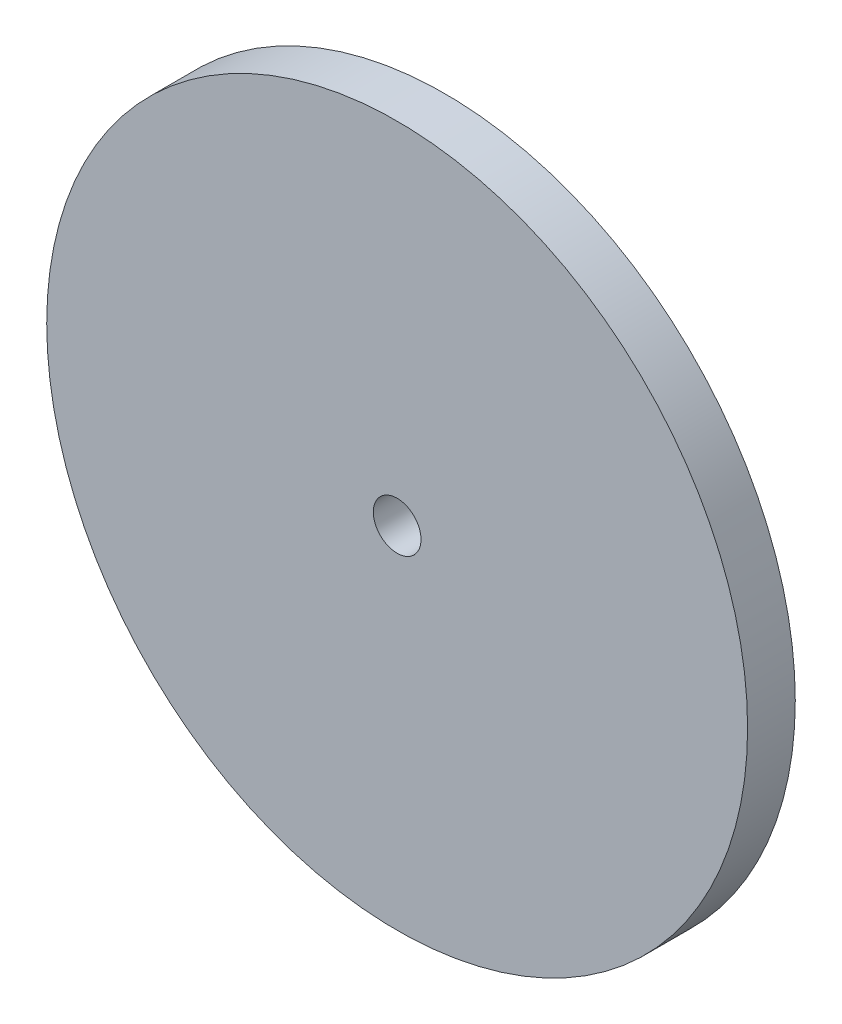
ISO-10303-21;
HEADER;
FILE_DESCRIPTION(('STEP AP214'),'2;1');
FILE_NAME('part.step','',(''),(''),'','','');
FILE_SCHEMA(('AUTOMOTIVE_DESIGN { 1 0 10303 214 1 1 1 1 }'));
ENDSEC;
DATA;
#1=APPLICATION_CONTEXT('core data for automotive mechanical design processes');
#2=APPLICATION_PROTOCOL_DEFINITION('international standard','automotive_design',2000,#1);
#3=PRODUCT_CONTEXT('',#1,'mechanical');
#4=PRODUCT('Part','Part','',(#3));
#5=PRODUCT_RELATED_PRODUCT_CATEGORY('part','',(#4));
#6=PRODUCT_DEFINITION_FORMATION('','',#4);
#7=PRODUCT_DEFINITION_CONTEXT('part definition',#1,'design');
#8=PRODUCT_DEFINITION('design','',#6,#7);
#9=PRODUCT_DEFINITION_SHAPE('','',#8);
#10=(LENGTH_UNIT() NAMED_UNIT(*) SI_UNIT(.MILLI.,.METRE.));
#11=(NAMED_UNIT(*) PLANE_ANGLE_UNIT() SI_UNIT($,.RADIAN.));
#12=(NAMED_UNIT(*) SI_UNIT($,.STERADIAN.) SOLID_ANGLE_UNIT());
#13=UNCERTAINTY_MEASURE_WITH_UNIT(LENGTH_MEASURE(1.E-05),#10,'distance_accuracy_value','');
#14=(GEOMETRIC_REPRESENTATION_CONTEXT(3) GLOBAL_UNCERTAINTY_ASSIGNED_CONTEXT((#13)) GLOBAL_UNIT_ASSIGNED_CONTEXT((#10,
#11,#12)) REPRESENTATION_CONTEXT('',''));
#15=CARTESIAN_POINT('',(0.,0.,0.));
#16=DIRECTION('',(0.,0.,1.));
#17=DIRECTION('',(1.,0.,0.));
#18=AXIS2_PLACEMENT_3D('',#15,#16,#17);
#19=CARTESIAN_POINT('',(0.,0.,1.));
#20=DIRECTION('',(0.,0.,1.));
#21=DIRECTION('',(1.,0.,0.));
#22=AXIS2_PLACEMENT_3D('',#19,#20,#21);
#23=PLANE('',#22);
#24=CARTESIAN_POINT('',(0.,0.,1.));
#25=DIRECTION('',(0.,0.,1.));
#26=DIRECTION('',(1.,0.,0.));
#27=AXIS2_PLACEMENT_3D('',#24,#25,#26);
#28=CIRCLE('',#27,7.35);
#29=CARTESIAN_POINT('',(7.35,0.,1.));
#30=VERTEX_POINT('',#29);
#31=EDGE_CURVE('E10',#30,#30,#28,.T.);
#32=ORIENTED_EDGE('',*,*,#31,.T.);
#33=EDGE_LOOP('',(#32));
#34=FACE_BOUND('',#33,.T.);
#35=CARTESIAN_POINT('',(0.,0.,1.));
#36=DIRECTION('',(0.,0.,1.));
#37=DIRECTION('',(1.,0.,0.));
#38=AXIS2_PLACEMENT_3D('',#35,#36,#37);
#39=CIRCLE('',#38,0.5);
#40=CARTESIAN_POINT('',(0.5,0.,1.));
#41=VERTEX_POINT('',#40);
#42=EDGE_CURVE('E42',#41,#41,#39,.T.);
#43=ORIENTED_EDGE('',*,*,#42,.F.);
#44=EDGE_LOOP('',(#43));
#45=FACE_BOUND('',#44,.T.);
#46=ADVANCED_FACE('F31',(#34,#45),#23,.T.);
#47=CARTESIAN_POINT('',(0.,0.,0.));
#48=DIRECTION('',(0.,0.,1.));
#49=DIRECTION('',(1.,0.,0.));
#50=AXIS2_PLACEMENT_3D('',#47,#48,#49);
#51=PLANE('',#50);
#52=CARTESIAN_POINT('',(0.,0.,0.));
#53=DIRECTION('',(0.,0.,1.));
#54=DIRECTION('',(1.,0.,0.));
#55=AXIS2_PLACEMENT_3D('',#52,#53,#54);
#56=CIRCLE('',#55,7.35);
#57=CARTESIAN_POINT('',(7.35,0.,0.));
#58=VERTEX_POINT('',#57);
#59=EDGE_CURVE('E35',#58,#58,#56,.T.);
#60=ORIENTED_EDGE('',*,*,#59,.F.);
#61=EDGE_LOOP('',(#60));
#62=FACE_BOUND('',#61,.T.);
#63=CARTESIAN_POINT('',(0.,0.,0.));
#64=DIRECTION('',(0.,0.,1.));
#65=DIRECTION('',(1.,0.,0.));
#66=AXIS2_PLACEMENT_3D('',#63,#64,#65);
#67=CIRCLE('',#66,0.5);
#68=CARTESIAN_POINT('',(0.5,0.,0.));
#69=VERTEX_POINT('',#68);
#70=EDGE_CURVE('E44',#69,#69,#67,.T.);
#71=ORIENTED_EDGE('',*,*,#70,.T.);
#72=EDGE_LOOP('',(#71));
#73=FACE_BOUND('',#72,.T.);
#74=ADVANCED_FACE('F54',(#62,#73),#51,.F.);
#75=CARTESIAN_POINT('',(0.,0.,1.));
#76=DIRECTION('',(0.,0.,-1.));
#77=DIRECTION('',(-1.,0.,0.));
#78=AXIS2_PLACEMENT_3D('',#75,#76,#77);
#79=CYLINDRICAL_SURFACE('',#78,7.35);
#80=ORIENTED_EDGE('',*,*,#31,.F.);
#81=EDGE_LOOP('',(#80));
#82=FACE_BOUND('',#81,.T.);
#83=ORIENTED_EDGE('',*,*,#59,.T.);
#84=EDGE_LOOP('',(#83));
#85=FACE_BOUND('',#84,.T.);
#86=ADVANCED_FACE('F33',(#82,#85),#79,.T.);
#87=CARTESIAN_POINT('',(0.,0.,1.));
#88=DIRECTION('',(0.,0.,-1.));
#89=DIRECTION('',(-1.,0.,0.));
#90=AXIS2_PLACEMENT_3D('',#87,#88,#89);
#91=CYLINDRICAL_SURFACE('',#90,0.5);
#92=ORIENTED_EDGE('',*,*,#42,.T.);
#93=EDGE_LOOP('',(#92));
#94=FACE_BOUND('',#93,.T.);
#95=ORIENTED_EDGE('',*,*,#70,.F.);
#96=EDGE_LOOP('',(#95));
#97=FACE_BOUND('',#96,.T.);
#98=ADVANCED_FACE('F50',(#94,#97),#91,.F.);
#99=CLOSED_SHELL('',(#46,#74,#86,#98));
#100=MANIFOLD_SOLID_BREP('B2',#99);
#101=ADVANCED_BREP_SHAPE_REPRESENTATION('',(#18,#100),#14);
#102=SHAPE_DEFINITION_REPRESENTATION(#9,#101);
ENDSEC;
END-ISO-10303-21;
